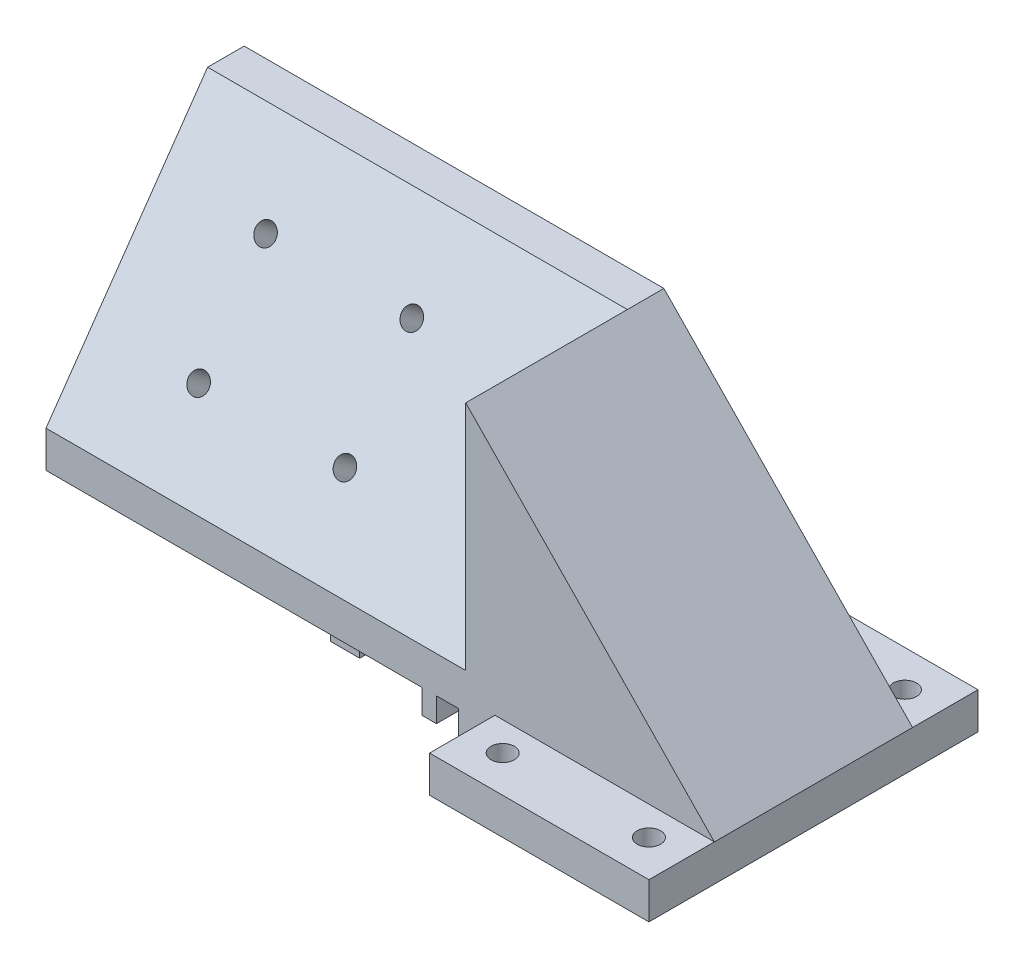
ISO-10303-21;
HEADER;
FILE_DESCRIPTION(('STEP AP214'),'2;1');
FILE_NAME('part.step','',(''),(''),'','','');
FILE_SCHEMA(('AUTOMOTIVE_DESIGN { 1 0 10303 214 1 1 1 1 }'));
ENDSEC;
DATA;
#1=APPLICATION_CONTEXT('core data for automotive mechanical design processes');
#2=APPLICATION_PROTOCOL_DEFINITION('international standard','automotive_design',2000,#1);
#3=PRODUCT_CONTEXT('',#1,'mechanical');
#4=PRODUCT('Part','Part','',(#3));
#5=PRODUCT_RELATED_PRODUCT_CATEGORY('part','',(#4));
#6=PRODUCT_DEFINITION_FORMATION('','',#4);
#7=PRODUCT_DEFINITION_CONTEXT('part definition',#1,'design');
#8=PRODUCT_DEFINITION('design','',#6,#7);
#9=PRODUCT_DEFINITION_SHAPE('','',#8);
#10=(LENGTH_UNIT() NAMED_UNIT(*) SI_UNIT(.MILLI.,.METRE.));
#11=(NAMED_UNIT(*) PLANE_ANGLE_UNIT() SI_UNIT($,.RADIAN.));
#12=(NAMED_UNIT(*) SI_UNIT($,.STERADIAN.) SOLID_ANGLE_UNIT());
#13=UNCERTAINTY_MEASURE_WITH_UNIT(LENGTH_MEASURE(1.E-05),#10,'distance_accuracy_value','');
#14=(GEOMETRIC_REPRESENTATION_CONTEXT(3) GLOBAL_UNCERTAINTY_ASSIGNED_CONTEXT((#13)) GLOBAL_UNIT_ASSIGNED_CONTEXT((#10,
#11,#12)) REPRESENTATION_CONTEXT('',''));
#15=CARTESIAN_POINT('',(0.,0.,0.));
#16=DIRECTION('',(0.,0.,1.));
#17=DIRECTION('',(1.,0.,0.));
#18=AXIS2_PLACEMENT_3D('',#15,#16,#17);
#19=CARTESIAN_POINT('',(0.,3.3,0.));
#20=DIRECTION('',(0.,1.,0.));
#21=DIRECTION('',(0.,0.,1.));
#22=AXIS2_PLACEMENT_3D('',#19,#20,#21);
#23=PLANE('',#22);
#24=DIRECTION('',(0.,0.,1.));
#25=VECTOR('',#24,1.);
#26=CARTESIAN_POINT('',(-76.4,3.3,-13.55));
#27=LINE('',#26,#25);
#28=CARTESIAN_POINT('',(-76.4,3.30000000000001,8.55000000000001));
#29=VERTEX_POINT('',#28);
#30=CARTESIAN_POINT('',(-76.4,3.3,13.55));
#31=VERTEX_POINT('',#30);
#32=EDGE_CURVE('E555',#29,#31,#27,.T.);
#33=ORIENTED_EDGE('',*,*,#32,.F.);
#34=DIRECTION('',(1.,0.,0.));
#35=VECTOR('',#34,1.);
#36=CARTESIAN_POINT('',(-67.,3.30000000000001,8.55000000000001));
#37=LINE('',#36,#35);
#38=CARTESIAN_POINT('',(-40.,3.30000000000001,8.55000000000001));
#39=VERTEX_POINT('',#38);
#40=EDGE_CURVE('E481',#29,#39,#37,.T.);
#41=ORIENTED_EDGE('',*,*,#40,.T.);
#42=DIRECTION('',(0.,0.,-1.));
#43=VECTOR('',#42,1.);
#44=CARTESIAN_POINT('',(-40.,3.3,0.));
#45=LINE('',#44,#43);
#46=CARTESIAN_POINT('',(-40.,3.3,11.05));
#47=VERTEX_POINT('',#46);
#48=EDGE_CURVE('E333',#47,#39,#45,.T.);
#49=ORIENTED_EDGE('',*,*,#48,.F.);
#50=DIRECTION('',(1.,0.,0.));
#51=VECTOR('',#50,1.);
#52=CARTESIAN_POINT('',(0.,3.3,11.05));
#53=LINE('',#52,#51);
#54=CARTESIAN_POINT('',(-36.,3.3,11.05));
#55=VERTEX_POINT('',#54);
#56=EDGE_CURVE('E347',#47,#55,#53,.T.);
#57=ORIENTED_EDGE('',*,*,#56,.T.);
#58=DIRECTION('',(0.,0.,-1.));
#59=VECTOR('',#58,1.);
#60=CARTESIAN_POINT('',(-36.,3.3,0.));
#61=LINE('',#60,#59);
#62=CARTESIAN_POINT('',(-36.,3.3,-13.55));
#63=VERTEX_POINT('',#62);
#64=EDGE_CURVE('E327',#55,#63,#61,.T.);
#65=ORIENTED_EDGE('',*,*,#64,.T.);
#66=DIRECTION('',(-1.,0.,0.));
#67=VECTOR('',#66,1.);
#68=CARTESIAN_POINT('',(0.,3.3,-13.55));
#69=LINE('',#68,#67);
#70=CARTESIAN_POINT('',(-25.,3.3,-13.55));
#71=VERTEX_POINT('',#70);
#72=EDGE_CURVE('E370',#71,#63,#69,.T.);
#73=ORIENTED_EDGE('',*,*,#72,.F.);
#74=DIRECTION('',(0.,0.,-1.));
#75=VECTOR('',#74,1.);
#76=CARTESIAN_POINT('',(-25.,3.3,0.));
#77=LINE('',#76,#75);
#78=CARTESIAN_POINT('',(-25.,3.3,13.55));
#79=VERTEX_POINT('',#78);
#80=EDGE_CURVE('E274',#79,#71,#77,.T.);
#81=ORIENTED_EDGE('',*,*,#80,.F.);
#82=DIRECTION('',(-1.,0.,0.));
#83=VECTOR('',#82,1.);
#84=CARTESIAN_POINT('',(0.,3.3,13.55));
#85=LINE('',#84,#83);
#86=EDGE_CURVE('E375',#79,#31,#85,.T.);
#87=ORIENTED_EDGE('',*,*,#86,.T.);
#88=EDGE_LOOP('',(#33,#41,#49,#57,#65,#73,#81,#87));
#89=FACE_BOUND('',#88,.T.);
#90=ADVANCED_FACE('F47',(#89),#23,.F.);
#91=CARTESIAN_POINT('',(-62.,8.40856632282748,-34.0678446970446));
#92=DIRECTION('',(0.,0.571898215133174,0.820324589127675));
#93=DIRECTION('',(0.,-0.820324589127675,0.571898215133174));
#94=AXIS2_PLACEMENT_3D('',#91,#92,#93);
#95=CYLINDRICAL_SURFACE('',#94,1.4);
#96=CARTESIAN_POINT('',(-62.,30.7125967130213,-2.0751857210653));
#97=DIRECTION('',(0.,0.571898215133174,0.820324589127675));
#98=DIRECTION('',(0.,-0.820324589127675,0.571898215133174));
#99=AXIS2_PLACEMENT_3D('',#96,#97,#98);
#100=CIRCLE('',#99,1.4);
#101=CARTESIAN_POINT('',(-62.,29.5641422882425,-1.27452821987885));
#102=VERTEX_POINT('',#101);
#103=EDGE_CURVE('E258',#102,#102,#100,.T.);
#104=ORIENTED_EDGE('',*,*,#103,.T.);
#105=EDGE_LOOP('',(#104));
#106=FACE_BOUND('',#105,.T.);
#107=CARTESIAN_POINT('',(-62.,27.8531056373554,-6.17680866670368));
#108=DIRECTION('',(0.,-0.571898215133175,-0.820324589127675));
#109=DIRECTION('',(0.,0.820324589127675,-0.571898215133175));
#110=AXIS2_PLACEMENT_3D('',#107,#108,#109);
#111=CIRCLE('',#110,1.4);
#112=CARTESIAN_POINT('',(-62.,29.0015600621342,-6.97746616789013));
#113=VERTEX_POINT('',#112);
#114=EDGE_CURVE('E545',#113,#113,#111,.F.);
#115=ORIENTED_EDGE('',*,*,#114,.F.);
#116=EDGE_LOOP('',(#115));
#117=FACE_BOUND('',#116,.T.);
#118=ADVANCED_FACE('F580',(#106,#117),#95,.F.);
#119=CARTESIAN_POINT('',(-41.9999954707796,-4.71662710321463,-24.9174732549143));
#120=DIRECTION('',(0.,0.571898215133174,0.820324589127675));
#121=DIRECTION('',(0.,-0.820324589127675,0.571898215133174));
#122=AXIS2_PLACEMENT_3D('',#119,#120,#121);
#123=CYLINDRICAL_SURFACE('',#122,1.4);
#124=CARTESIAN_POINT('',(-41.9999954707796,17.5874032869792,7.07518572106501));
#125=DIRECTION('',(0.,0.571898215133174,0.820324589127675));
#126=DIRECTION('',(0.,-0.820324589127675,0.571898215133174));
#127=AXIS2_PLACEMENT_3D('',#124,#125,#126);
#128=CIRCLE('',#127,1.4);
#129=CARTESIAN_POINT('',(-41.9999954707796,16.4389488622004,7.87584322225145));
#130=VERTEX_POINT('',#129);
#131=EDGE_CURVE('E566',#130,#130,#128,.T.);
#132=ORIENTED_EDGE('',*,*,#131,.T.);
#133=EDGE_LOOP('',(#132));
#134=FACE_BOUND('',#133,.T.);
#135=CARTESIAN_POINT('',(-41.9999954707796,14.7279122113133,2.97356277542663));
#136=DIRECTION('',(0.,-0.571898215133175,-0.820324589127675));
#137=DIRECTION('',(0.,0.820324589127675,-0.571898215133175));
#138=AXIS2_PLACEMENT_3D('',#135,#136,#137);
#139=CIRCLE('',#138,1.4);
#140=CARTESIAN_POINT('',(-41.9999954707796,15.8763666360921,2.17290527424019));
#141=VERTEX_POINT('',#140);
#142=EDGE_CURVE('E541',#141,#141,#139,.F.);
#143=ORIENTED_EDGE('',*,*,#142,.F.);
#144=EDGE_LOOP('',(#143));
#145=FACE_BOUND('',#144,.T.);
#146=ADVANCED_FACE('F698',(#134,#145),#123,.F.);
#147=CARTESIAN_POINT('',(-42.,8.40856632282771,-34.0678446970448));
#148=DIRECTION('',(0.,0.571898215133174,0.820324589127675));
#149=DIRECTION('',(0.,-0.820324589127675,0.571898215133174));
#150=AXIS2_PLACEMENT_3D('',#147,#148,#149);
#151=CYLINDRICAL_SURFACE('',#150,1.4);
#152=CARTESIAN_POINT('',(-42.,30.7125967130215,-2.07518572106546));
#153=DIRECTION('',(0.,0.571898215133174,0.820324589127675));
#154=DIRECTION('',(0.,-0.820324589127675,0.571898215133174));
#155=AXIS2_PLACEMENT_3D('',#152,#153,#154);
#156=CIRCLE('',#155,1.4);
#157=CARTESIAN_POINT('',(-42.,29.5641422882428,-1.27452821987901));
#158=VERTEX_POINT('',#157);
#159=EDGE_CURVE('E570',#158,#158,#156,.T.);
#160=ORIENTED_EDGE('',*,*,#159,.T.);
#161=EDGE_LOOP('',(#160));
#162=FACE_BOUND('',#161,.T.);
#163=CARTESIAN_POINT('',(-42.,27.8531056373556,-6.17680866670384));
#164=DIRECTION('',(0.,-0.571898215133175,-0.820324589127675));
#165=DIRECTION('',(0.,0.820324589127675,-0.571898215133175));
#166=AXIS2_PLACEMENT_3D('',#163,#164,#165);
#167=CIRCLE('',#166,1.4);
#168=CARTESIAN_POINT('',(-42.,29.0015600621344,-6.97746616789029));
#169=VERTEX_POINT('',#168);
#170=EDGE_CURVE('E480',#169,#169,#167,.F.);
#171=ORIENTED_EDGE('',*,*,#170,.F.);
#172=EDGE_LOOP('',(#171));
#173=FACE_BOUND('',#172,.T.);
#174=ADVANCED_FACE('F764',(#162,#173),#151,.F.);
#175=CARTESIAN_POINT('',(-61.9999954707796,-4.7166271032148,-24.9174732549142));
#176=DIRECTION('',(0.,0.571898215133174,0.820324589127675));
#177=DIRECTION('',(0.,-0.820324589127675,0.571898215133174));
#178=AXIS2_PLACEMENT_3D('',#175,#176,#177);
#179=CYLINDRICAL_SURFACE('',#178,1.4);
#180=CARTESIAN_POINT('',(-61.9999954707796,17.587403286979,7.07518572106513));
#181=DIRECTION('',(0.,0.571898215133174,0.820324589127675));
#182=DIRECTION('',(0.,-0.820324589127675,0.571898215133174));
#183=AXIS2_PLACEMENT_3D('',#180,#181,#182);
#184=CIRCLE('',#183,1.4);
#185=CARTESIAN_POINT('',(-61.9999954707796,16.4389488622003,7.87584322225157));
#186=VERTEX_POINT('',#185);
#187=EDGE_CURVE('E565',#186,#186,#184,.T.);
#188=ORIENTED_EDGE('',*,*,#187,.T.);
#189=EDGE_LOOP('',(#188));
#190=FACE_BOUND('',#189,.T.);
#191=CARTESIAN_POINT('',(-61.9999954707796,14.7279122113131,2.97356277542675));
#192=DIRECTION('',(0.,-0.571898215133175,-0.820324589127675));
#193=DIRECTION('',(0.,0.820324589127675,-0.571898215133175));
#194=AXIS2_PLACEMENT_3D('',#191,#192,#193);
#195=CIRCLE('',#194,1.4);
#196=CARTESIAN_POINT('',(-61.9999954707796,15.8763666360919,2.1729052742403));
#197=VERTEX_POINT('',#196);
#198=EDGE_CURVE('E476',#197,#197,#195,.F.);
#199=ORIENTED_EDGE('',*,*,#198,.F.);
#200=EDGE_LOOP('',(#199));
#201=FACE_BOUND('',#200,.T.);
#202=ADVANCED_FACE('F759',(#190,#201),#179,.F.);
#203=CARTESIAN_POINT('',(0.,3.3,13.55));
#204=DIRECTION('',(0.,0.,-1.));
#205=DIRECTION('',(-1.,0.,0.));
#206=AXIS2_PLACEMENT_3D('',#203,#204,#205);
#207=PLANE('',#206);
#208=DIRECTION('',(-1.,0.,0.));
#209=VECTOR('',#208,1.);
#210=CARTESIAN_POINT('',(0.,5.,13.55));
#211=LINE('',#210,#209);
#212=CARTESIAN_POINT('',(15.,5.,13.55));
#213=VERTEX_POINT('',#212);
#214=CARTESIAN_POINT('',(-15.,5.,13.55));
#215=VERTEX_POINT('',#214);
#216=EDGE_CURVE('E249',#213,#215,#211,.T.);
#217=ORIENTED_EDGE('',*,*,#216,.F.);
#218=DIRECTION('',(0.696785684263249,-0.717279380859227,0.));
#219=VECTOR('',#218,1.);
#220=CARTESIAN_POINT('',(-19.,40.,13.55));
#221=LINE('',#220,#219);
#222=CARTESIAN_POINT('',(-19.,40.,13.55));
#223=VERTEX_POINT('',#222);
#224=EDGE_CURVE('E230',#223,#213,#221,.T.);
#225=ORIENTED_EDGE('',*,*,#224,.F.);
#226=DIRECTION('',(0.,1.,0.));
#227=VECTOR('',#226,1.);
#228=CARTESIAN_POINT('',(-19.,0.,13.55));
#229=LINE('',#228,#227);
#230=CARTESIAN_POINT('',(-19.,8.3,13.55));
#231=VERTEX_POINT('',#230);
#232=EDGE_CURVE('E241',#231,#223,#229,.T.);
#233=ORIENTED_EDGE('',*,*,#232,.F.);
#234=DIRECTION('',(-1.,0.,0.));
#235=VECTOR('',#234,1.);
#236=CARTESIAN_POINT('',(-19.,8.3,13.55));
#237=LINE('',#236,#235);
#238=CARTESIAN_POINT('',(-76.4,8.3,13.55));
#239=VERTEX_POINT('',#238);
#240=EDGE_CURVE('E240',#231,#239,#237,.T.);
#241=ORIENTED_EDGE('',*,*,#240,.T.);
#242=DIRECTION('',(0.,1.,0.));
#243=VECTOR('',#242,1.);
#244=CARTESIAN_POINT('',(-76.4,40.,13.55));
#245=LINE('',#244,#243);
#246=EDGE_CURVE('E558',#31,#239,#245,.T.);
#247=ORIENTED_EDGE('',*,*,#246,.F.);
#248=ORIENTED_EDGE('',*,*,#86,.F.);
#249=DIRECTION('',(0.,1.,0.));
#250=VECTOR('',#249,1.);
#251=CARTESIAN_POINT('',(-25.,0.,13.55));
#252=LINE('',#251,#250);
#253=CARTESIAN_POINT('',(-25.,0.,13.55));
#254=VERTEX_POINT('',#253);
#255=EDGE_CURVE('E296',#254,#79,#252,.T.);
#256=ORIENTED_EDGE('',*,*,#255,.F.);
#257=DIRECTION('',(-1.,0.,0.));
#258=VECTOR('',#257,1.);
#259=CARTESIAN_POINT('',(0.,0.,13.55));
#260=LINE('',#259,#258);
#261=CARTESIAN_POINT('',(-23.,0.,13.55));
#262=VERTEX_POINT('',#261);
#263=EDGE_CURVE('E273',#262,#254,#260,.T.);
#264=ORIENTED_EDGE('',*,*,#263,.F.);
#265=DIRECTION('',(0.,1.,0.));
#266=VECTOR('',#265,1.);
#267=CARTESIAN_POINT('',(-23.,0.,13.55));
#268=LINE('',#267,#266);
#269=CARTESIAN_POINT('',(-23.,3.3,13.55));
#270=VERTEX_POINT('',#269);
#271=EDGE_CURVE('E300',#262,#270,#268,.T.);
#272=ORIENTED_EDGE('',*,*,#271,.T.);
#273=CARTESIAN_POINT('',(-20.,3.3,13.55));
#274=VERTEX_POINT('',#273);
#275=EDGE_CURVE('E376',#274,#270,#85,.T.);
#276=ORIENTED_EDGE('',*,*,#275,.F.);
#277=DIRECTION('',(0.,1.,0.));
#278=VECTOR('',#277,1.);
#279=CARTESIAN_POINT('',(-20.,0.,13.55));
#280=LINE('',#279,#278);
#281=CARTESIAN_POINT('',(-20.,0.,13.55));
#282=VERTEX_POINT('',#281);
#283=EDGE_CURVE('E323',#282,#274,#280,.T.);
#284=ORIENTED_EDGE('',*,*,#283,.F.);
#285=DIRECTION('',(-1.,0.,0.));
#286=VECTOR('',#285,1.);
#287=CARTESIAN_POINT('',(0.,0.,13.55));
#288=LINE('',#287,#286);
#289=CARTESIAN_POINT('',(-15.,0.,13.55));
#290=VERTEX_POINT('',#289);
#291=EDGE_CURVE('E305',#290,#282,#288,.T.);
#292=ORIENTED_EDGE('',*,*,#291,.F.);
#293=DIRECTION('',(0.,1.,0.));
#294=VECTOR('',#293,1.);
#295=CARTESIAN_POINT('',(-15.,5.,13.55));
#296=LINE('',#295,#294);
#297=EDGE_CURVE('E379',#290,#215,#296,.T.);
#298=ORIENTED_EDGE('',*,*,#297,.T.);
#299=EDGE_LOOP('',(#217,#225,#233,#241,#247,#248,#256,#264,#272,#276,#284,#292,#298));
#300=FACE_BOUND('',#299,.T.);
#301=ADVANCED_FACE('F246',(#300),#207,.F.);
#302=CARTESIAN_POINT('',(0.,40.,0.));
#303=DIRECTION('',(0.,1.,0.));
#304=DIRECTION('',(0.,0.,1.));
#305=AXIS2_PLACEMENT_3D('',#302,#303,#304);
#306=PLANE('',#305);
#307=DIRECTION('',(0.,0.,1.));
#308=VECTOR('',#307,1.);
#309=CARTESIAN_POINT('',(-19.,40.,-22.5));
#310=LINE('',#309,#308);
#311=CARTESIAN_POINT('',(-19.,40.,-13.55));
#312=VERTEX_POINT('',#311);
#313=CARTESIAN_POINT('',(-19.,40.,-8.54999999999998));
#314=VERTEX_POINT('',#313);
#315=EDGE_CURVE('E233',#312,#314,#310,.T.);
#316=ORIENTED_EDGE('',*,*,#315,.F.);
#317=DIRECTION('',(-1.,0.,0.));
#318=VECTOR('',#317,1.);
#319=CARTESIAN_POINT('',(0.,40.,-13.55));
#320=LINE('',#319,#318);
#321=CARTESIAN_POINT('',(-76.4,40.,-13.55));
#322=VERTEX_POINT('',#321);
#323=EDGE_CURVE('E367',#312,#322,#320,.T.);
#324=ORIENTED_EDGE('',*,*,#323,.T.);
#325=DIRECTION('',(0.,0.,-1.));
#326=VECTOR('',#325,1.);
#327=CARTESIAN_POINT('',(-76.4,40.,-13.55));
#328=LINE('',#327,#326);
#329=CARTESIAN_POINT('',(-76.4,40.,-8.54999999999999));
#330=VERTEX_POINT('',#329);
#331=EDGE_CURVE('E561',#330,#322,#328,.T.);
#332=ORIENTED_EDGE('',*,*,#331,.F.);
#333=DIRECTION('',(-1.,0.,0.));
#334=VECTOR('',#333,1.);
#335=CARTESIAN_POINT('',(-19.,40.,-8.54999999999998));
#336=LINE('',#335,#334);
#337=EDGE_CURVE('E262',#314,#330,#336,.T.);
#338=ORIENTED_EDGE('',*,*,#337,.F.);
#339=EDGE_LOOP('',(#316,#324,#332,#338));
#340=FACE_BOUND('',#339,.T.);
#341=ADVANCED_FACE('F591',(#340),#306,.T.);
#342=CARTESIAN_POINT('',(0.,3.3,-13.55));
#343=DIRECTION('',(0.,0.,-1.));
#344=DIRECTION('',(-1.,0.,0.));
#345=AXIS2_PLACEMENT_3D('',#342,#343,#344);
#346=PLANE('',#345);
#347=DIRECTION('',(-0.696785684263249,0.717279380859227,0.));
#348=VECTOR('',#347,1.);
#349=CARTESIAN_POINT('',(8.5669886602268,11.6222175556489,-13.55));
#350=LINE('',#349,#348);
#351=CARTESIAN_POINT('',(15.,5.,-13.55));
#352=VERTEX_POINT('',#351);
#353=EDGE_CURVE('E595',#352,#312,#350,.T.);
#354=ORIENTED_EDGE('',*,*,#353,.F.);
#355=DIRECTION('',(-1.,0.,0.));
#356=VECTOR('',#355,1.);
#357=CARTESIAN_POINT('',(0.,5.,-13.55));
#358=LINE('',#357,#356);
#359=CARTESIAN_POINT('',(-15.,5.,-13.55));
#360=VERTEX_POINT('',#359);
#361=EDGE_CURVE('E468',#352,#360,#358,.T.);
#362=ORIENTED_EDGE('',*,*,#361,.T.);
#363=DIRECTION('',(0.,1.,0.));
#364=VECTOR('',#363,1.);
#365=CARTESIAN_POINT('',(-15.,5.,-13.55));
#366=LINE('',#365,#364);
#367=CARTESIAN_POINT('',(-15.,0.,-13.55));
#368=VERTEX_POINT('',#367);
#369=EDGE_CURVE('E382',#368,#360,#366,.T.);
#370=ORIENTED_EDGE('',*,*,#369,.F.);
#371=DIRECTION('',(1.,0.,0.));
#372=VECTOR('',#371,1.);
#373=CARTESIAN_POINT('',(0.,0.,-13.55));
#374=LINE('',#373,#372);
#375=CARTESIAN_POINT('',(-20.,0.,-13.55));
#376=VERTEX_POINT('',#375);
#377=EDGE_CURVE('E312',#376,#368,#374,.T.);
#378=ORIENTED_EDGE('',*,*,#377,.F.);
#379=DIRECTION('',(0.,1.,0.));
#380=VECTOR('',#379,1.);
#381=CARTESIAN_POINT('',(-20.,0.,-13.55));
#382=LINE('',#381,#380);
#383=CARTESIAN_POINT('',(-20.,3.3,-13.55));
#384=VERTEX_POINT('',#383);
#385=EDGE_CURVE('E316',#376,#384,#382,.T.);
#386=ORIENTED_EDGE('',*,*,#385,.T.);
#387=CARTESIAN_POINT('',(-23.,3.3,-13.55));
#388=VERTEX_POINT('',#387);
#389=EDGE_CURVE('E371',#384,#388,#69,.T.);
#390=ORIENTED_EDGE('',*,*,#389,.T.);
#391=DIRECTION('',(0.,1.,0.));
#392=VECTOR('',#391,1.);
#393=CARTESIAN_POINT('',(-23.,0.,-13.55));
#394=LINE('',#393,#392);
#395=CARTESIAN_POINT('',(-23.,0.,-13.55));
#396=VERTEX_POINT('',#395);
#397=EDGE_CURVE('E283',#396,#388,#394,.T.);
#398=ORIENTED_EDGE('',*,*,#397,.F.);
#399=DIRECTION('',(1.,0.,0.));
#400=VECTOR('',#399,1.);
#401=CARTESIAN_POINT('',(0.,0.,-13.55));
#402=LINE('',#401,#400);
#403=CARTESIAN_POINT('',(-25.,0.,-13.55));
#404=VERTEX_POINT('',#403);
#405=EDGE_CURVE('E280',#404,#396,#402,.T.);
#406=ORIENTED_EDGE('',*,*,#405,.F.);
#407=DIRECTION('',(0.,1.,0.));
#408=VECTOR('',#407,1.);
#409=CARTESIAN_POINT('',(-25.,0.,-13.55));
#410=LINE('',#409,#408);
#411=EDGE_CURVE('E292',#404,#71,#410,.T.);
#412=ORIENTED_EDGE('',*,*,#411,.T.);
#413=ORIENTED_EDGE('',*,*,#72,.T.);
#414=DIRECTION('',(0.,1.,0.));
#415=VECTOR('',#414,1.);
#416=CARTESIAN_POINT('',(-36.,0.,-13.55));
#417=LINE('',#416,#415);
#418=CARTESIAN_POINT('',(-36.,0.,-13.55));
#419=VERTEX_POINT('',#418);
#420=EDGE_CURVE('E343',#419,#63,#417,.T.);
#421=ORIENTED_EDGE('',*,*,#420,.F.);
#422=DIRECTION('',(1.,0.,0.));
#423=VECTOR('',#422,1.);
#424=CARTESIAN_POINT('',(0.,0.,-13.55));
#425=LINE('',#424,#423);
#426=CARTESIAN_POINT('',(-40.,0.,-13.55));
#427=VERTEX_POINT('',#426);
#428=EDGE_CURVE('E340',#427,#419,#425,.T.);
#429=ORIENTED_EDGE('',*,*,#428,.F.);
#430=DIRECTION('',(0.,1.,0.));
#431=VECTOR('',#430,1.);
#432=CARTESIAN_POINT('',(-40.,0.,-13.55));
#433=LINE('',#432,#431);
#434=CARTESIAN_POINT('',(-40.,3.3,-13.55));
#435=VERTEX_POINT('',#434);
#436=EDGE_CURVE('E357',#427,#435,#433,.T.);
#437=ORIENTED_EDGE('',*,*,#436,.T.);
#438=DIRECTION('',(1.,0.,0.));
#439=VECTOR('',#438,1.);
#440=CARTESIAN_POINT('',(-67.,3.3,-13.55));
#441=LINE('',#440,#439);
#442=CARTESIAN_POINT('',(-37.,3.3,-13.55));
#443=VERTEX_POINT('',#442);
#444=EDGE_CURVE('E524',#435,#443,#441,.T.);
#445=ORIENTED_EDGE('',*,*,#444,.T.);
#446=DIRECTION('',(0.,-1.,0.));
#447=VECTOR('',#446,1.);
#448=CARTESIAN_POINT('',(-37.,35.,-13.55));
#449=LINE('',#448,#447);
#450=CARTESIAN_POINT('',(-37.,34.9320054204283,-13.55));
#451=VERTEX_POINT('',#450);
#452=EDGE_CURVE('E505',#451,#443,#449,.T.);
#453=ORIENTED_EDGE('',*,*,#452,.F.);
#454=CARTESIAN_POINT('',(-39.,34.9320054204283,-13.55));
#455=DIRECTION('',(0.,0.,-1.));
#456=DIRECTION('',(0.,-1.,0.));
#457=AXIS2_PLACEMENT_3D('',#454,#455,#456);
#458=ELLIPSE('',#457,3.49712579455117,2.);
#459=CARTESIAN_POINT('',(-37.0003780655682,35.,-13.55));
#460=VERTEX_POINT('',#459);
#461=EDGE_CURVE('E11',#451,#460,#458,.F.);
#462=ORIENTED_EDGE('',*,*,#461,.T.);
#463=DIRECTION('',(1.,0.,0.));
#464=VECTOR('',#463,1.);
#465=CARTESIAN_POINT('',(-67.,35.,-13.55));
#466=LINE('',#465,#464);
#467=CARTESIAN_POINT('',(-76.4,35.,-13.55));
#468=VERTEX_POINT('',#467);
#469=EDGE_CURVE('E515',#468,#460,#466,.T.);
#470=ORIENTED_EDGE('',*,*,#469,.F.);
#471=DIRECTION('',(0.,-1.,0.));
#472=VECTOR('',#471,1.);
#473=CARTESIAN_POINT('',(-76.4,40.,-13.55));
#474=LINE('',#473,#472);
#475=EDGE_CURVE('E552',#322,#468,#474,.T.);
#476=ORIENTED_EDGE('',*,*,#475,.F.);
#477=ORIENTED_EDGE('',*,*,#323,.F.);
#478=EDGE_LOOP('',(#354,#362,#370,#378,#386,#390,#398,#406,#412,#413,#421,#429,#437,#445,#453,
#462,#470,#476,#477));
#479=FACE_BOUND('',#478,.T.);
#480=ADVANCED_FACE('F513',(#479),#346,.T.);
#481=CARTESIAN_POINT('',(-19.,9.07153719949107,13.0121144445189));
#482=DIRECTION('',(0.,0.571898215133175,0.820324589127675));
#483=DIRECTION('',(0.,-0.820324589127675,0.571898215133174));
#484=AXIS2_PLACEMENT_3D('',#481,#482,#483);
#485=PLANE('',#484);
#486=ORIENTED_EDGE('',*,*,#187,.F.);
#487=EDGE_LOOP('',(#486));
#488=FACE_BOUND('',#487,.T.);
#489=ORIENTED_EDGE('',*,*,#159,.F.);
#490=EDGE_LOOP('',(#489));
#491=FACE_BOUND('',#490,.T.);
#492=ORIENTED_EDGE('',*,*,#131,.F.);
#493=EDGE_LOOP('',(#492));
#494=FACE_BOUND('',#493,.T.);
#495=ORIENTED_EDGE('',*,*,#103,.F.);
#496=EDGE_LOOP('',(#495));
#497=FACE_BOUND('',#496,.T.);
#498=ORIENTED_EDGE('',*,*,#337,.T.);
#499=DIRECTION('',(0.,-0.820324589127675,0.571898215133174));
#500=VECTOR('',#499,1.);
#501=CARTESIAN_POINT('',(-76.4,9.07153719949107,13.0121144445189));
#502=LINE('',#501,#500);
#503=EDGE_CURVE('E471',#330,#239,#502,.T.);
#504=ORIENTED_EDGE('',*,*,#503,.T.);
#505=ORIENTED_EDGE('',*,*,#240,.F.);
#506=DIRECTION('',(0.,0.820324589127675,-0.571898215133174));
#507=VECTOR('',#506,1.);
#508=CARTESIAN_POINT('',(-19.,9.07153719949107,13.0121144445189));
#509=LINE('',#508,#507);
#510=EDGE_CURVE('E254',#231,#314,#509,.T.);
#511=ORIENTED_EDGE('',*,*,#510,.T.);
#512=EDGE_LOOP('',(#498,#504,#505,#511));
#513=FACE_BOUND('',#512,.T.);
#514=ADVANCED_FACE('F583',(#488,#491,#494,#497,#513),#485,.T.);
#515=CARTESIAN_POINT('',(-15.,5.,0.));
#516=DIRECTION('',(1.,0.,0.));
#517=DIRECTION('',(0.,0.,-1.));
#518=AXIS2_PLACEMENT_3D('',#515,#516,#517);
#519=PLANE('',#518);
#520=ORIENTED_EDGE('',*,*,#297,.F.);
#521=DIRECTION('',(0.,0.,1.));
#522=VECTOR('',#521,1.);
#523=CARTESIAN_POINT('',(-15.,0.,0.));
#524=LINE('',#523,#522);
#525=CARTESIAN_POINT('',(-15.,0.,22.5));
#526=VERTEX_POINT('',#525);
#527=EDGE_CURVE('E446',#290,#526,#524,.T.);
#528=ORIENTED_EDGE('',*,*,#527,.T.);
#529=DIRECTION('',(0.,-1.,0.));
#530=VECTOR('',#529,1.);
#531=CARTESIAN_POINT('',(-15.,5.,22.5));
#532=LINE('',#531,#530);
#533=CARTESIAN_POINT('',(-15.,5.,22.5));
#534=VERTEX_POINT('',#533);
#535=EDGE_CURVE('E456',#534,#526,#532,.T.);
#536=ORIENTED_EDGE('',*,*,#535,.F.);
#537=DIRECTION('',(0.,0.,1.));
#538=VECTOR('',#537,1.);
#539=CARTESIAN_POINT('',(-15.,5.,0.));
#540=LINE('',#539,#538);
#541=EDGE_CURVE('E413',#215,#534,#540,.T.);
#542=ORIENTED_EDGE('',*,*,#541,.F.);
#543=EDGE_LOOP('',(#520,#528,#536,#542));
#544=FACE_BOUND('',#543,.T.);
#545=ADVANCED_FACE('F586',(#544),#519,.F.);
#546=CARTESIAN_POINT('',(-15.,0.,-22.5));
#547=VERTEX_POINT('',#546);
#548=EDGE_CURVE('E447',#547,#368,#524,.T.);
#549=ORIENTED_EDGE('',*,*,#548,.T.);
#550=ORIENTED_EDGE('',*,*,#369,.T.);
#551=CARTESIAN_POINT('',(-15.,5.,-22.5));
#552=VERTEX_POINT('',#551);
#553=EDGE_CURVE('E414',#552,#360,#540,.T.);
#554=ORIENTED_EDGE('',*,*,#553,.F.);
#555=DIRECTION('',(0.,-1.,0.));
#556=VECTOR('',#555,1.);
#557=CARTESIAN_POINT('',(-15.,5.,-22.5));
#558=LINE('',#557,#556);
#559=EDGE_CURVE('E460',#552,#547,#558,.T.);
#560=ORIENTED_EDGE('',*,*,#559,.T.);
#561=EDGE_LOOP('',(#549,#550,#554,#560));
#562=FACE_BOUND('',#561,.T.);
#563=ADVANCED_FACE('F614',(#562),#519,.F.);
#564=ORIENTED_EDGE('',*,*,#275,.T.);
#565=DIRECTION('',(0.,0.,-1.));
#566=VECTOR('',#565,1.);
#567=CARTESIAN_POINT('',(-23.,3.3,0.));
#568=LINE('',#567,#566);
#569=EDGE_CURVE('E266',#270,#388,#568,.T.);
#570=ORIENTED_EDGE('',*,*,#569,.T.);
#571=ORIENTED_EDGE('',*,*,#389,.F.);
#572=DIRECTION('',(0.,0.,-1.));
#573=VECTOR('',#572,1.);
#574=CARTESIAN_POINT('',(-20.,3.3,0.));
#575=LINE('',#574,#573);
#576=EDGE_CURVE('E304',#274,#384,#575,.T.);
#577=ORIENTED_EDGE('',*,*,#576,.F.);
#578=EDGE_LOOP('',(#564,#570,#571,#577));
#579=FACE_BOUND('',#578,.T.);
#580=ADVANCED_FACE('F626',(#579),#23,.F.);
#581=CARTESIAN_POINT('',(0.,5.,0.));
#582=DIRECTION('',(0.,1.,0.));
#583=DIRECTION('',(0.,0.,1.));
#584=AXIS2_PLACEMENT_3D('',#581,#582,#583);
#585=PLANE('',#584);
#586=CARTESIAN_POINT('',(10.0000000000002,5.,17.5));
#587=DIRECTION('',(0.,1.,0.));
#588=DIRECTION('',(0.,0.,1.));
#589=AXIS2_PLACEMENT_3D('',#586,#587,#588);
#590=CIRCLE('',#589,1.6);
#591=CARTESIAN_POINT('',(10.0000000000002,5.,19.1));
#592=VERTEX_POINT('',#591);
#593=EDGE_CURVE('E391',#592,#592,#590,.T.);
#594=ORIENTED_EDGE('',*,*,#593,.F.);
#595=EDGE_LOOP('',(#594));
#596=FACE_BOUND('',#595,.T.);
#597=CARTESIAN_POINT('',(-9.99999999999979,5.,17.5));
#598=DIRECTION('',(0.,1.,0.));
#599=DIRECTION('',(0.,0.,1.));
#600=AXIS2_PLACEMENT_3D('',#597,#598,#599);
#601=CIRCLE('',#600,1.6);
#602=CARTESIAN_POINT('',(-9.99999999999979,5.,19.1));
#603=VERTEX_POINT('',#602);
#604=EDGE_CURVE('E387',#603,#603,#601,.T.);
#605=ORIENTED_EDGE('',*,*,#604,.F.);
#606=EDGE_LOOP('',(#605));
#607=FACE_BOUND('',#606,.T.);
#608=DIRECTION('',(0.,0.,1.));
#609=VECTOR('',#608,1.);
#610=CARTESIAN_POINT('',(15.,5.,0.));
#611=LINE('',#610,#609);
#612=CARTESIAN_POINT('',(15.,5.,22.5));
#613=VERTEX_POINT('',#612);
#614=EDGE_CURVE('E404',#213,#613,#611,.T.);
#615=ORIENTED_EDGE('',*,*,#614,.F.);
#616=ORIENTED_EDGE('',*,*,#216,.T.);
#617=ORIENTED_EDGE('',*,*,#541,.T.);
#618=DIRECTION('',(1.,0.,0.));
#619=VECTOR('',#618,1.);
#620=CARTESIAN_POINT('',(0.,5.,22.5));
#621=LINE('',#620,#619);
#622=EDGE_CURVE('E418',#534,#613,#621,.T.);
#623=ORIENTED_EDGE('',*,*,#622,.T.);
#624=EDGE_LOOP('',(#615,#616,#617,#623));
#625=FACE_BOUND('',#624,.T.);
#626=ADVANCED_FACE('F655',(#596,#607,#625),#585,.T.);
#627=CARTESIAN_POINT('',(15.,5.,0.));
#628=DIRECTION('',(1.,0.,0.));
#629=DIRECTION('',(0.,0.,-1.));
#630=AXIS2_PLACEMENT_3D('',#627,#628,#629);
#631=PLANE('',#630);
#632=DIRECTION('',(0.,0.,1.));
#633=VECTOR('',#632,1.);
#634=CARTESIAN_POINT('',(15.,5.,-22.5));
#635=LINE('',#634,#633);
#636=EDGE_CURVE('E598',#352,#213,#635,.T.);
#637=ORIENTED_EDGE('',*,*,#636,.T.);
#638=ORIENTED_EDGE('',*,*,#614,.T.);
#639=DIRECTION('',(0.,-1.,0.));
#640=VECTOR('',#639,1.);
#641=CARTESIAN_POINT('',(15.,5.,22.5));
#642=LINE('',#641,#640);
#643=CARTESIAN_POINT('',(15.,0.,22.5));
#644=VERTEX_POINT('',#643);
#645=EDGE_CURVE('E422',#613,#644,#642,.T.);
#646=ORIENTED_EDGE('',*,*,#645,.T.);
#647=DIRECTION('',(0.,0.,1.));
#648=VECTOR('',#647,1.);
#649=CARTESIAN_POINT('',(15.,0.,0.));
#650=LINE('',#649,#648);
#651=CARTESIAN_POINT('',(15.,0.,-22.5));
#652=VERTEX_POINT('',#651);
#653=EDGE_CURVE('E438',#652,#644,#650,.T.);
#654=ORIENTED_EDGE('',*,*,#653,.F.);
#655=DIRECTION('',(0.,-1.,0.));
#656=VECTOR('',#655,1.);
#657=CARTESIAN_POINT('',(15.,5.,-22.5));
#658=LINE('',#657,#656);
#659=CARTESIAN_POINT('',(15.,5.,-22.5));
#660=VERTEX_POINT('',#659);
#661=EDGE_CURVE('E463',#660,#652,#658,.T.);
#662=ORIENTED_EDGE('',*,*,#661,.F.);
#663=EDGE_CURVE('E405',#660,#352,#611,.T.);
#664=ORIENTED_EDGE('',*,*,#663,.T.);
#665=EDGE_LOOP('',(#637,#638,#646,#654,#662,#664));
#666=FACE_BOUND('',#665,.T.);
#667=ADVANCED_FACE('F607',(#666),#631,.T.);
#668=CARTESIAN_POINT('',(0.,5.,-22.5));
#669=DIRECTION('',(0.,0.,-1.));
#670=DIRECTION('',(-1.,0.,0.));
#671=AXIS2_PLACEMENT_3D('',#668,#669,#670);
#672=PLANE('',#671);
#673=DIRECTION('',(1.,0.,0.));
#674=VECTOR('',#673,1.);
#675=CARTESIAN_POINT('',(0.,0.,-22.5));
#676=LINE('',#675,#674);
#677=EDGE_CURVE('E442',#547,#652,#676,.T.);
#678=ORIENTED_EDGE('',*,*,#677,.F.);
#679=ORIENTED_EDGE('',*,*,#559,.F.);
#680=DIRECTION('',(1.,0.,0.));
#681=VECTOR('',#680,1.);
#682=CARTESIAN_POINT('',(0.,5.,-22.5));
#683=LINE('',#682,#681);
#684=EDGE_CURVE('E409',#552,#660,#683,.T.);
#685=ORIENTED_EDGE('',*,*,#684,.T.);
#686=ORIENTED_EDGE('',*,*,#661,.T.);
#687=EDGE_LOOP('',(#678,#679,#685,#686));
#688=FACE_BOUND('',#687,.T.);
#689=ADVANCED_FACE('F611',(#688),#672,.T.);
#690=CARTESIAN_POINT('',(-10.,5.,-17.5));
#691=DIRECTION('',(0.,-1.,0.));
#692=DIRECTION('',(0.,0.,-1.));
#693=AXIS2_PLACEMENT_3D('',#690,#691,#692);
#694=CYLINDRICAL_SURFACE('',#693,1.6);
#695=CARTESIAN_POINT('',(-10.,5.,-17.5));
#696=DIRECTION('',(0.,1.,0.));
#697=DIRECTION('',(0.,0.,1.));
#698=AXIS2_PLACEMENT_3D('',#695,#696,#697);
#699=CIRCLE('',#698,1.6);
#700=CARTESIAN_POINT('',(-10.,5.,-15.9));
#701=VERTEX_POINT('',#700);
#702=EDGE_CURVE('E400',#701,#701,#699,.T.);
#703=ORIENTED_EDGE('',*,*,#702,.T.);
#704=EDGE_LOOP('',(#703));
#705=FACE_BOUND('',#704,.T.);
#706=CARTESIAN_POINT('',(-10.,0.,-17.5));
#707=DIRECTION('',(0.,1.,0.));
#708=DIRECTION('',(0.,0.,1.));
#709=AXIS2_PLACEMENT_3D('',#706,#707,#708);
#710=CIRCLE('',#709,1.6);
#711=CARTESIAN_POINT('',(-10.,0.,-15.9));
#712=VERTEX_POINT('',#711);
#713=EDGE_CURVE('E434',#712,#712,#710,.T.);
#714=ORIENTED_EDGE('',*,*,#713,.F.);
#715=EDGE_LOOP('',(#714));
#716=FACE_BOUND('',#715,.T.);
#717=ADVANCED_FACE('F719',(#705,#716),#694,.F.);
#718=CARTESIAN_POINT('',(10.,5.,-17.5));
#719=DIRECTION('',(0.,-1.,0.));
#720=DIRECTION('',(0.,0.,-1.));
#721=AXIS2_PLACEMENT_3D('',#718,#719,#720);
#722=CYLINDRICAL_SURFACE('',#721,1.6);
#723=CARTESIAN_POINT('',(10.,5.,-17.5));
#724=DIRECTION('',(0.,1.,0.));
#725=DIRECTION('',(0.,0.,1.));
#726=AXIS2_PLACEMENT_3D('',#723,#724,#725);
#727=CIRCLE('',#726,1.6);
#728=CARTESIAN_POINT('',(10.,5.,-15.9));
#729=VERTEX_POINT('',#728);
#730=EDGE_CURVE('E396',#729,#729,#727,.T.);
#731=ORIENTED_EDGE('',*,*,#730,.T.);
#732=EDGE_LOOP('',(#731));
#733=FACE_BOUND('',#732,.T.);
#734=CARTESIAN_POINT('',(10.,0.,-17.5));
#735=DIRECTION('',(0.,1.,0.));
#736=DIRECTION('',(0.,0.,1.));
#737=AXIS2_PLACEMENT_3D('',#734,#735,#736);
#738=CIRCLE('',#737,1.6);
#739=CARTESIAN_POINT('',(10.,0.,-15.9));
#740=VERTEX_POINT('',#739);
#741=EDGE_CURVE('E430',#740,#740,#738,.T.);
#742=ORIENTED_EDGE('',*,*,#741,.F.);
#743=EDGE_LOOP('',(#742));
#744=FACE_BOUND('',#743,.T.);
#745=ADVANCED_FACE('F724',(#733,#744),#722,.F.);
#746=CARTESIAN_POINT('',(10.0000000000002,5.,17.5));
#747=DIRECTION('',(0.,-1.,0.));
#748=DIRECTION('',(0.,0.,-1.));
#749=AXIS2_PLACEMENT_3D('',#746,#747,#748);
#750=CYLINDRICAL_SURFACE('',#749,1.6);
#751=ORIENTED_EDGE('',*,*,#593,.T.);
#752=EDGE_LOOP('',(#751));
#753=FACE_BOUND('',#752,.T.);
#754=CARTESIAN_POINT('',(10.0000000000002,0.,17.5));
#755=DIRECTION('',(0.,1.,0.));
#756=DIRECTION('',(0.,0.,1.));
#757=AXIS2_PLACEMENT_3D('',#754,#755,#756);
#758=CIRCLE('',#757,1.6);
#759=CARTESIAN_POINT('',(10.0000000000002,0.,19.1));
#760=VERTEX_POINT('',#759);
#761=EDGE_CURVE('E426',#760,#760,#758,.T.);
#762=ORIENTED_EDGE('',*,*,#761,.F.);
#763=EDGE_LOOP('',(#762));
#764=FACE_BOUND('',#763,.T.);
#765=ADVANCED_FACE('F728',(#753,#764),#750,.F.);
#766=CARTESIAN_POINT('',(-9.99999999999979,5.,17.5));
#767=DIRECTION('',(0.,-1.,0.));
#768=DIRECTION('',(0.,0.,-1.));
#769=AXIS2_PLACEMENT_3D('',#766,#767,#768);
#770=CYLINDRICAL_SURFACE('',#769,1.6);
#771=ORIENTED_EDGE('',*,*,#604,.T.);
#772=EDGE_LOOP('',(#771));
#773=FACE_BOUND('',#772,.T.);
#774=CARTESIAN_POINT('',(-9.99999999999979,0.,17.5));
#775=DIRECTION('',(0.,1.,0.));
#776=DIRECTION('',(0.,0.,1.));
#777=AXIS2_PLACEMENT_3D('',#774,#775,#776);
#778=CIRCLE('',#777,1.6);
#779=CARTESIAN_POINT('',(-9.99999999999979,0.,19.1));
#780=VERTEX_POINT('',#779);
#781=EDGE_CURVE('E386',#780,#780,#778,.T.);
#782=ORIENTED_EDGE('',*,*,#781,.F.);
#783=EDGE_LOOP('',(#782));
#784=FACE_BOUND('',#783,.T.);
#785=ADVANCED_FACE('F731',(#773,#784),#770,.F.);
#786=CARTESIAN_POINT('',(0.,5.,22.5));
#787=DIRECTION('',(0.,0.,-1.));
#788=DIRECTION('',(-1.,0.,0.));
#789=AXIS2_PLACEMENT_3D('',#786,#787,#788);
#790=PLANE('',#789);
#791=DIRECTION('',(1.,0.,0.));
#792=VECTOR('',#791,1.);
#793=CARTESIAN_POINT('',(0.,0.,22.5));
#794=LINE('',#793,#792);
#795=EDGE_CURVE('E392',#526,#644,#794,.T.);
#796=ORIENTED_EDGE('',*,*,#795,.T.);
#797=ORIENTED_EDGE('',*,*,#645,.F.);
#798=ORIENTED_EDGE('',*,*,#622,.F.);
#799=ORIENTED_EDGE('',*,*,#535,.T.);
#800=EDGE_LOOP('',(#796,#797,#798,#799));
#801=FACE_BOUND('',#800,.T.);
#802=ADVANCED_FACE('F660',(#801),#790,.F.);
#803=ORIENTED_EDGE('',*,*,#361,.F.);
#804=ORIENTED_EDGE('',*,*,#663,.F.);
#805=ORIENTED_EDGE('',*,*,#684,.F.);
#806=ORIENTED_EDGE('',*,*,#553,.T.);
#807=EDGE_LOOP('',(#803,#804,#805,#806));
#808=FACE_BOUND('',#807,.T.);
#809=ORIENTED_EDGE('',*,*,#730,.F.);
#810=EDGE_LOOP('',(#809));
#811=FACE_BOUND('',#810,.T.);
#812=ORIENTED_EDGE('',*,*,#702,.F.);
#813=EDGE_LOOP('',(#812));
#814=FACE_BOUND('',#813,.T.);
#815=ADVANCED_FACE('F602',(#808,#811,#814),#585,.T.);
#816=CARTESIAN_POINT('',(0.,0.,0.));
#817=DIRECTION('',(0.,1.,0.));
#818=DIRECTION('',(0.,0.,1.));
#819=AXIS2_PLACEMENT_3D('',#816,#817,#818);
#820=PLANE('',#819);
#821=ORIENTED_EDGE('',*,*,#781,.T.);
#822=EDGE_LOOP('',(#821));
#823=FACE_BOUND('',#822,.T.);
#824=ORIENTED_EDGE('',*,*,#761,.T.);
#825=EDGE_LOOP('',(#824));
#826=FACE_BOUND('',#825,.T.);
#827=ORIENTED_EDGE('',*,*,#741,.T.);
#828=EDGE_LOOP('',(#827));
#829=FACE_BOUND('',#828,.T.);
#830=ORIENTED_EDGE('',*,*,#713,.T.);
#831=EDGE_LOOP('',(#830));
#832=FACE_BOUND('',#831,.T.);
#833=ORIENTED_EDGE('',*,*,#653,.T.);
#834=ORIENTED_EDGE('',*,*,#795,.F.);
#835=ORIENTED_EDGE('',*,*,#527,.F.);
#836=ORIENTED_EDGE('',*,*,#291,.T.);
#837=DIRECTION('',(0.,0.,-1.));
#838=VECTOR('',#837,1.);
#839=CARTESIAN_POINT('',(-20.,0.,0.));
#840=LINE('',#839,#838);
#841=EDGE_CURVE('E309',#282,#376,#840,.T.);
#842=ORIENTED_EDGE('',*,*,#841,.T.);
#843=ORIENTED_EDGE('',*,*,#377,.T.);
#844=ORIENTED_EDGE('',*,*,#548,.F.);
#845=ORIENTED_EDGE('',*,*,#677,.T.);
#846=EDGE_LOOP('',(#833,#834,#835,#836,#842,#843,#844,#845));
#847=FACE_BOUND('',#846,.T.);
#848=ADVANCED_FACE('F618',(#823,#826,#829,#832,#847),#820,.F.);
#849=CARTESIAN_POINT('',(-36.,0.,0.));
#850=DIRECTION('',(1.,0.,0.));
#851=DIRECTION('',(0.,0.,-1.));
#852=AXIS2_PLACEMENT_3D('',#849,#850,#851);
#853=PLANE('',#852);
#854=ORIENTED_EDGE('',*,*,#64,.F.);
#855=DIRECTION('',(0.,1.,0.));
#856=VECTOR('',#855,1.);
#857=CARTESIAN_POINT('',(-36.,0.,11.05));
#858=LINE('',#857,#856);
#859=CARTESIAN_POINT('',(-36.,0.,11.05));
#860=VERTEX_POINT('',#859);
#861=EDGE_CURVE('E364',#860,#55,#858,.T.);
#862=ORIENTED_EDGE('',*,*,#861,.F.);
#863=DIRECTION('',(0.,0.,-1.));
#864=VECTOR('',#863,1.);
#865=CARTESIAN_POINT('',(-36.,0.,0.));
#866=LINE('',#865,#864);
#867=EDGE_CURVE('E328',#860,#419,#866,.T.);
#868=ORIENTED_EDGE('',*,*,#867,.T.);
#869=ORIENTED_EDGE('',*,*,#420,.T.);
#870=EDGE_LOOP('',(#854,#862,#868,#869));
#871=FACE_BOUND('',#870,.T.);
#872=ADVANCED_FACE('F679',(#871),#853,.T.);
#873=CARTESIAN_POINT('',(0.,0.,11.05));
#874=DIRECTION('',(0.,0.,1.));
#875=DIRECTION('',(1.,0.,0.));
#876=AXIS2_PLACEMENT_3D('',#873,#874,#875);
#877=PLANE('',#876);
#878=ORIENTED_EDGE('',*,*,#56,.F.);
#879=DIRECTION('',(0.,1.,0.));
#880=VECTOR('',#879,1.);
#881=CARTESIAN_POINT('',(-40.,0.,11.05));
#882=LINE('',#881,#880);
#883=CARTESIAN_POINT('',(-40.,0.,11.05));
#884=VERTEX_POINT('',#883);
#885=EDGE_CURVE('E361',#884,#47,#882,.T.);
#886=ORIENTED_EDGE('',*,*,#885,.F.);
#887=DIRECTION('',(1.,0.,0.));
#888=VECTOR('',#887,1.);
#889=CARTESIAN_POINT('',(0.,0.,11.05));
#890=LINE('',#889,#888);
#891=EDGE_CURVE('E332',#884,#860,#890,.T.);
#892=ORIENTED_EDGE('',*,*,#891,.T.);
#893=ORIENTED_EDGE('',*,*,#861,.T.);
#894=EDGE_LOOP('',(#878,#886,#892,#893));
#895=FACE_BOUND('',#894,.T.);
#896=ADVANCED_FACE('F676',(#895),#877,.T.);
#897=CARTESIAN_POINT('',(-40.,0.,0.));
#898=DIRECTION('',(1.,0.,0.));
#899=DIRECTION('',(0.,0.,-1.));
#900=AXIS2_PLACEMENT_3D('',#897,#898,#899);
#901=PLANE('',#900);
#902=ORIENTED_EDGE('',*,*,#48,.T.);
#903=DIRECTION('',(0.,0.,1.));
#904=VECTOR('',#903,1.);
#905=CARTESIAN_POINT('',(-40.,3.30000000000001,0.));
#906=LINE('',#905,#904);
#907=EDGE_CURVE('E549',#435,#39,#906,.T.);
#908=ORIENTED_EDGE('',*,*,#907,.F.);
#909=ORIENTED_EDGE('',*,*,#436,.F.);
#910=DIRECTION('',(0.,0.,-1.));
#911=VECTOR('',#910,1.);
#912=CARTESIAN_POINT('',(-40.,0.,0.));
#913=LINE('',#912,#911);
#914=EDGE_CURVE('E337',#884,#427,#913,.T.);
#915=ORIENTED_EDGE('',*,*,#914,.F.);
#916=ORIENTED_EDGE('',*,*,#885,.T.);
#917=EDGE_LOOP('',(#902,#908,#909,#915,#916));
#918=FACE_BOUND('',#917,.T.);
#919=ADVANCED_FACE('F670',(#918),#901,.F.);
#920=CARTESIAN_POINT('',(0.,0.,0.));
#921=DIRECTION('',(0.,-1.,0.));
#922=DIRECTION('',(0.,0.,-1.));
#923=AXIS2_PLACEMENT_3D('',#920,#921,#922);
#924=PLANE('',#923);
#925=ORIENTED_EDGE('',*,*,#867,.F.);
#926=ORIENTED_EDGE('',*,*,#891,.F.);
#927=ORIENTED_EDGE('',*,*,#914,.T.);
#928=ORIENTED_EDGE('',*,*,#428,.T.);
#929=EDGE_LOOP('',(#925,#926,#927,#928));
#930=FACE_BOUND('',#929,.T.);
#931=ADVANCED_FACE('F682',(#930),#924,.T.);
#932=CARTESIAN_POINT('',(-20.,0.,0.));
#933=DIRECTION('',(1.,0.,0.));
#934=DIRECTION('',(0.,0.,-1.));
#935=AXIS2_PLACEMENT_3D('',#932,#933,#934);
#936=PLANE('',#935);
#937=ORIENTED_EDGE('',*,*,#576,.T.);
#938=ORIENTED_EDGE('',*,*,#385,.F.);
#939=ORIENTED_EDGE('',*,*,#841,.F.);
#940=ORIENTED_EDGE('',*,*,#283,.T.);
#941=EDGE_LOOP('',(#937,#938,#939,#940));
#942=FACE_BOUND('',#941,.T.);
#943=ADVANCED_FACE('F623',(#942),#936,.F.);
#944=CARTESIAN_POINT('',(-23.,0.,0.));
#945=DIRECTION('',(1.,0.,0.));
#946=DIRECTION('',(0.,0.,-1.));
#947=AXIS2_PLACEMENT_3D('',#944,#945,#946);
#948=PLANE('',#947);
#949=ORIENTED_EDGE('',*,*,#569,.F.);
#950=ORIENTED_EDGE('',*,*,#271,.F.);
#951=DIRECTION('',(0.,0.,-1.));
#952=VECTOR('',#951,1.);
#953=CARTESIAN_POINT('',(-23.,0.,0.));
#954=LINE('',#953,#952);
#955=EDGE_CURVE('E269',#262,#396,#954,.T.);
#956=ORIENTED_EDGE('',*,*,#955,.T.);
#957=ORIENTED_EDGE('',*,*,#397,.T.);
#958=EDGE_LOOP('',(#949,#950,#956,#957));
#959=FACE_BOUND('',#958,.T.);
#960=ADVANCED_FACE('F631',(#959),#948,.T.);
#961=CARTESIAN_POINT('',(-25.,0.,0.));
#962=DIRECTION('',(1.,0.,0.));
#963=DIRECTION('',(0.,0.,-1.));
#964=AXIS2_PLACEMENT_3D('',#961,#962,#963);
#965=PLANE('',#964);
#966=ORIENTED_EDGE('',*,*,#80,.T.);
#967=ORIENTED_EDGE('',*,*,#411,.F.);
#968=DIRECTION('',(0.,0.,-1.));
#969=VECTOR('',#968,1.);
#970=CARTESIAN_POINT('',(-25.,0.,0.));
#971=LINE('',#970,#969);
#972=EDGE_CURVE('E277',#254,#404,#971,.T.);
#973=ORIENTED_EDGE('',*,*,#972,.F.);
#974=ORIENTED_EDGE('',*,*,#255,.T.);
#975=EDGE_LOOP('',(#966,#967,#973,#974));
#976=FACE_BOUND('',#975,.T.);
#977=ADVANCED_FACE('F641',(#976),#965,.F.);
#978=CARTESIAN_POINT('',(0.,0.,0.));
#979=DIRECTION('',(0.,-1.,0.));
#980=DIRECTION('',(0.,0.,-1.));
#981=AXIS2_PLACEMENT_3D('',#978,#979,#980);
#982=PLANE('',#981);
#983=ORIENTED_EDGE('',*,*,#955,.F.);
#984=ORIENTED_EDGE('',*,*,#263,.T.);
#985=ORIENTED_EDGE('',*,*,#972,.T.);
#986=ORIENTED_EDGE('',*,*,#405,.T.);
#987=EDGE_LOOP('',(#983,#984,#985,#986));
#988=FACE_BOUND('',#987,.T.);
#989=ADVANCED_FACE('F635',(#988),#982,.T.);
#990=CARTESIAN_POINT('',(-19.,0.,0.));
#991=DIRECTION('',(-1.,0.,0.));
#992=DIRECTION('',(0.,0.,1.));
#993=AXIS2_PLACEMENT_3D('',#990,#991,#992);
#994=PLANE('',#993);
#995=ORIENTED_EDGE('',*,*,#510,.F.);
#996=ORIENTED_EDGE('',*,*,#232,.T.);
#997=DIRECTION('',(0.,0.,-1.));
#998=VECTOR('',#997,1.);
#999=CARTESIAN_POINT('',(-19.,40.,0.));
#1000=LINE('',#999,#998);
#1001=EDGE_CURVE('E227',#223,#314,#1000,.T.);
#1002=ORIENTED_EDGE('',*,*,#1001,.T.);
#1003=EDGE_LOOP('',(#995,#996,#1002));
#1004=FACE_BOUND('',#1003,.T.);
#1005=ADVANCED_FACE('F253',(#1004),#994,.T.);
#1006=CARTESIAN_POINT('',(-76.4,0.,0.));
#1007=DIRECTION('',(-1.,0.,0.));
#1008=DIRECTION('',(0.,0.,1.));
#1009=AXIS2_PLACEMENT_3D('',#1006,#1007,#1008);
#1010=PLANE('',#1009);
#1011=DIRECTION('',(0.,0.,-1.));
#1012=VECTOR('',#1011,1.);
#1013=CARTESIAN_POINT('',(-76.4,35.,-11.1593438532792));
#1014=LINE('',#1013,#1012);
#1015=CARTESIAN_POINT('',(-76.4,35.,-11.1593438532792));
#1016=VERTEX_POINT('',#1015);
#1017=EDGE_CURVE('E520',#1016,#468,#1014,.T.);
#1018=ORIENTED_EDGE('',*,*,#1017,.F.);
#1019=DIRECTION('',(0.,0.820324589127675,-0.571898215133174));
#1020=VECTOR('',#1019,1.);
#1021=CARTESIAN_POINT('',(-76.4,6.72913121497953,8.55000000000002));
#1022=LINE('',#1021,#1020);
#1023=CARTESIAN_POINT('',(-76.4,6.72913121497953,8.55000000000002));
#1024=VERTEX_POINT('',#1023);
#1025=EDGE_CURVE('E507',#1024,#1016,#1022,.T.);
#1026=ORIENTED_EDGE('',*,*,#1025,.F.);
#1027=DIRECTION('',(0.,1.,0.));
#1028=VECTOR('',#1027,1.);
#1029=CARTESIAN_POINT('',(-76.4,3.30000000000001,8.55000000000001));
#1030=LINE('',#1029,#1028);
#1031=EDGE_CURVE('E666',#29,#1024,#1030,.T.);
#1032=ORIENTED_EDGE('',*,*,#1031,.F.);
#1033=ORIENTED_EDGE('',*,*,#32,.T.);
#1034=ORIENTED_EDGE('',*,*,#246,.T.);
#1035=ORIENTED_EDGE('',*,*,#503,.F.);
#1036=ORIENTED_EDGE('',*,*,#331,.T.);
#1037=ORIENTED_EDGE('',*,*,#475,.T.);
#1038=EDGE_LOOP('',(#1018,#1026,#1032,#1033,#1034,#1035,#1036,#1037));
#1039=FACE_BOUND('',#1038,.T.);
#1040=ADVANCED_FACE('F594',(#1039),#1010,.T.);
#1041=CARTESIAN_POINT('',(-67.,3.3,-13.55));
#1042=DIRECTION('',(0.,1.,0.));
#1043=DIRECTION('',(0.,0.,1.));
#1044=AXIS2_PLACEMENT_3D('',#1041,#1042,#1043);
#1045=PLANE('',#1044);
#1046=CARTESIAN_POINT('',(-37.0003780655682,3.30000000000001,8.55000000000001));
#1047=VERTEX_POINT('',#1046);
#1048=EDGE_CURVE('E499',#39,#1047,#37,.T.);
#1049=ORIENTED_EDGE('',*,*,#1048,.T.);
#1050=CARTESIAN_POINT('',(-39.,3.30000000000001,8.50259683884754));
#1051=DIRECTION('',(0.,1.,0.));
#1052=DIRECTION('',(0.,0.,1.));
#1053=AXIS2_PLACEMENT_3D('',#1050,#1051,#1052);
#1054=ELLIPSE('',#1053,2.43805930787321,2.);
#1055=CARTESIAN_POINT('',(-37.,3.30000000000001,8.50259683884754));
#1056=VERTEX_POINT('',#1055);
#1057=EDGE_CURVE('E56',#1047,#1056,#1054,.T.);
#1058=ORIENTED_EDGE('',*,*,#1057,.T.);
#1059=DIRECTION('',(0.,0.,1.));
#1060=VECTOR('',#1059,1.);
#1061=CARTESIAN_POINT('',(-37.,3.3,-13.55));
#1062=LINE('',#1061,#1060);
#1063=EDGE_CURVE('E497',#443,#1056,#1062,.T.);
#1064=ORIENTED_EDGE('',*,*,#1063,.F.);
#1065=ORIENTED_EDGE('',*,*,#444,.F.);
#1066=ORIENTED_EDGE('',*,*,#907,.T.);
#1067=EDGE_LOOP('',(#1049,#1058,#1064,#1065,#1066));
#1068=FACE_BOUND('',#1067,.T.);
#1069=ADVANCED_FACE('F496',(#1068),#1045,.T.);
#1070=CARTESIAN_POINT('',(-67.,6.72913121497953,8.55000000000002));
#1071=DIRECTION('',(0.,-0.571898215133175,-0.820324589127675));
#1072=DIRECTION('',(0.,0.820324589127675,-0.571898215133175));
#1073=AXIS2_PLACEMENT_3D('',#1070,#1071,#1072);
#1074=PLANE('',#1073);
#1075=DIRECTION('',(1.,0.,0.));
#1076=VECTOR('',#1075,1.);
#1077=CARTESIAN_POINT('',(-67.,35.,-11.1593438532792));
#1078=LINE('',#1077,#1076);
#1079=CARTESIAN_POINT('',(-39.,35.,-11.1593438532792));
#1080=VERTEX_POINT('',#1079);
#1081=EDGE_CURVE('E523',#1016,#1080,#1078,.T.);
#1082=ORIENTED_EDGE('',*,*,#1081,.T.);
#1083=DIRECTION('',(0.,0.820324589127675,-0.571898215133175));
#1084=VECTOR('',#1083,1.);
#1085=CARTESIAN_POINT('',(-39.,6.72913121497953,8.55000000000002));
#1086=LINE('',#1085,#1084);
#1087=CARTESIAN_POINT('',(-39.,6.72913121497953,8.55000000000002));
#1088=VERTEX_POINT('',#1087);
#1089=EDGE_CURVE('E71',#1080,#1088,#1086,.F.);
#1090=ORIENTED_EDGE('',*,*,#1089,.T.);
#1091=DIRECTION('',(1.,0.,0.));
#1092=VECTOR('',#1091,1.);
#1093=CARTESIAN_POINT('',(-67.,6.72913121497953,8.55000000000002));
#1094=LINE('',#1093,#1092);
#1095=EDGE_CURVE('E528',#1024,#1088,#1094,.T.);
#1096=ORIENTED_EDGE('',*,*,#1095,.F.);
#1097=ORIENTED_EDGE('',*,*,#1025,.T.);
#1098=EDGE_LOOP('',(#1082,#1090,#1096,#1097));
#1099=FACE_BOUND('',#1098,.T.);
#1100=ORIENTED_EDGE('',*,*,#198,.T.);
#1101=EDGE_LOOP('',(#1100));
#1102=FACE_BOUND('',#1101,.T.);
#1103=ORIENTED_EDGE('',*,*,#170,.T.);
#1104=EDGE_LOOP('',(#1103));
#1105=FACE_BOUND('',#1104,.T.);
#1106=ORIENTED_EDGE('',*,*,#142,.T.);
#1107=EDGE_LOOP('',(#1106));
#1108=FACE_BOUND('',#1107,.T.);
#1109=ORIENTED_EDGE('',*,*,#114,.T.);
#1110=EDGE_LOOP('',(#1109));
#1111=FACE_BOUND('',#1110,.T.);
#1112=ADVANCED_FACE('F998',(#1099,#1102,#1105,#1108,#1111),#1074,.T.);
#1113=CARTESIAN_POINT('',(-67.,3.30000000000001,8.55000000000001));
#1114=DIRECTION('',(0.,0.,-1.));
#1115=DIRECTION('',(0.,1.,0.));
#1116=AXIS2_PLACEMENT_3D('',#1113,#1114,#1115);
#1117=PLANE('',#1116);
#1118=ORIENTED_EDGE('',*,*,#1095,.T.);
#1119=CARTESIAN_POINT('',(-39.,3.23200542042837,8.55000000000001));
#1120=DIRECTION('',(0.,0.,-1.));
#1121=DIRECTION('',(0.,-1.,0.));
#1122=AXIS2_PLACEMENT_3D('',#1119,#1120,#1121);
#1123=ELLIPSE('',#1122,3.49712579455116,2.);
#1124=EDGE_CURVE('E63',#1088,#1047,#1123,.T.);
#1125=ORIENTED_EDGE('',*,*,#1124,.T.);
#1126=ORIENTED_EDGE('',*,*,#1048,.F.);
#1127=ORIENTED_EDGE('',*,*,#40,.F.);
#1128=ORIENTED_EDGE('',*,*,#1031,.T.);
#1129=EDGE_LOOP('',(#1118,#1125,#1126,#1127,#1128));
#1130=FACE_BOUND('',#1129,.T.);
#1131=ADVANCED_FACE('F994',(#1130),#1117,.T.);
#1132=CARTESIAN_POINT('',(-67.,35.,-11.1593438532792));
#1133=DIRECTION('',(0.,-1.,0.));
#1134=DIRECTION('',(0.,0.,-1.));
#1135=AXIS2_PLACEMENT_3D('',#1132,#1133,#1134);
#1136=PLANE('',#1135);
#1137=ORIENTED_EDGE('',*,*,#469,.T.);
#1138=CARTESIAN_POINT('',(-39.,35.,-13.5974031611525));
#1139=DIRECTION('',(0.,-1.,0.));
#1140=DIRECTION('',(0.,0.,1.));
#1141=AXIS2_PLACEMENT_3D('',#1138,#1139,#1140);
#1142=ELLIPSE('',#1141,2.43805930787322,2.);
#1143=EDGE_CURVE('E485',#460,#1080,#1142,.T.);
#1144=ORIENTED_EDGE('',*,*,#1143,.T.);
#1145=ORIENTED_EDGE('',*,*,#1081,.F.);
#1146=ORIENTED_EDGE('',*,*,#1017,.T.);
#1147=EDGE_LOOP('',(#1137,#1144,#1145,#1146));
#1148=FACE_BOUND('',#1147,.T.);
#1149=ADVANCED_FACE('F518',(#1148),#1136,.T.);
#1150=CARTESIAN_POINT('',(-37.,0.,0.));
#1151=DIRECTION('',(-1.,0.,0.));
#1152=DIRECTION('',(0.,0.,1.));
#1153=AXIS2_PLACEMENT_3D('',#1150,#1151,#1152);
#1154=PLANE('',#1153);
#1155=ORIENTED_EDGE('',*,*,#1063,.T.);
#1156=DIRECTION('',(0.,0.820324589127675,-0.571898215133175));
#1157=VECTOR('',#1156,1.);
#1158=CARTESIAN_POINT('',(-37.,33.8562035697337,-12.7999930315346));
#1159=LINE('',#1158,#1157);
#1160=EDGE_CURVE('E475',#1056,#451,#1159,.T.);
#1161=ORIENTED_EDGE('',*,*,#1160,.T.);
#1162=ORIENTED_EDGE('',*,*,#452,.T.);
#1163=EDGE_LOOP('',(#1155,#1161,#1162));
#1164=FACE_BOUND('',#1163,.T.);
#1165=ADVANCED_FACE('F503',(#1164),#1154,.T.);
#1166=CARTESIAN_POINT('',(-19.,40.,-22.5));
#1167=DIRECTION('',(-0.717279380859227,-0.696785684263249,0.));
#1168=DIRECTION('',(0.696785684263249,-0.717279380859227,0.));
#1169=AXIS2_PLACEMENT_3D('',#1166,#1167,#1168);
#1170=PLANE('',#1169);
#1171=ORIENTED_EDGE('',*,*,#353,.T.);
#1172=ORIENTED_EDGE('',*,*,#315,.T.);
#1173=ORIENTED_EDGE('',*,*,#1001,.F.);
#1174=ORIENTED_EDGE('',*,*,#224,.T.);
#1175=ORIENTED_EDGE('',*,*,#636,.F.);
#1176=EDGE_LOOP('',(#1171,#1172,#1173,#1174,#1175));
#1177=FACE_BOUND('',#1176,.T.);
#1178=ADVANCED_FACE('F229',(#1177),#1170,.F.);
#1179=CARTESIAN_POINT('',(-39.,5.06824969355885,7.26984232062513));
#1180=DIRECTION('',(0.,-0.820324589127675,0.571898215133175));
#1181=DIRECTION('',(0.,-0.571898215133175,-0.820324589127675));
#1182=AXIS2_PLACEMENT_3D('',#1179,#1180,#1181);
#1183=CYLINDRICAL_SURFACE('',#1182,2.);
#1184=ORIENTED_EDGE('',*,*,#1124,.F.);
#1185=ORIENTED_EDGE('',*,*,#1089,.F.);
#1186=ORIENTED_EDGE('',*,*,#1143,.F.);
#1187=ORIENTED_EDGE('',*,*,#461,.F.);
#1188=ORIENTED_EDGE('',*,*,#1160,.F.);
#1189=ORIENTED_EDGE('',*,*,#1057,.F.);
#1190=EDGE_LOOP('',(#1184,#1185,#1186,#1187,#1188,#1189));
#1191=FACE_BOUND('',#1190,.T.);
#1192=ADVANCED_FACE('F49',(#1191),#1183,.F.);
#1193=CLOSED_SHELL('',(#90,#118,#146,#174,#202,#301,#341,#480,#514,#545,#563,#580,#626,#667,
#689,#717,#745,#765,#785,#802,#815,#848,#872,#896,#919,#931,#943,#960,#977,#989,#1005,#1040,
#1069,#1112,#1131,#1149,#1165,#1178,#1192));
#1194=MANIFOLD_SOLID_BREP('B2',#1193);
#1195=ADVANCED_BREP_SHAPE_REPRESENTATION('',(#18,#1194),#14);
#1196=SHAPE_DEFINITION_REPRESENTATION(#9,#1195);
ENDSEC;
END-ISO-10303-21;
